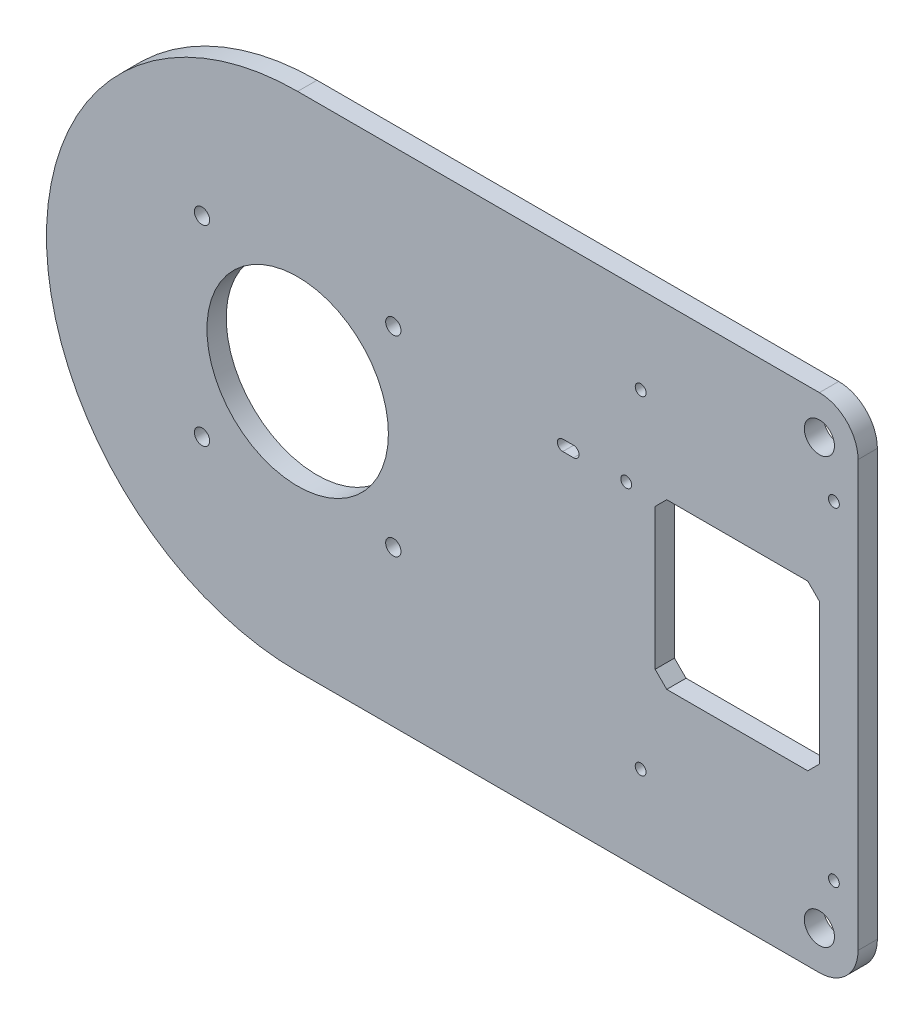
ISO-10303-21;
HEADER;
FILE_DESCRIPTION(('STEP AP214'),'2;1');
FILE_NAME('part.step','',(''),(''),'','','');
FILE_SCHEMA(('AUTOMOTIVE_DESIGN { 1 0 10303 214 1 1 1 1 }'));
ENDSEC;
DATA;
#1=APPLICATION_CONTEXT('core data for automotive mechanical design processes');
#2=APPLICATION_PROTOCOL_DEFINITION('international standard','automotive_design',2000,#1);
#3=PRODUCT_CONTEXT('',#1,'mechanical');
#4=PRODUCT('Part','Part','',(#3));
#5=PRODUCT_RELATED_PRODUCT_CATEGORY('part','',(#4));
#6=PRODUCT_DEFINITION_FORMATION('','',#4);
#7=PRODUCT_DEFINITION_CONTEXT('part definition',#1,'design');
#8=PRODUCT_DEFINITION('design','',#6,#7);
#9=PRODUCT_DEFINITION_SHAPE('','',#8);
#10=(LENGTH_UNIT() NAMED_UNIT(*) SI_UNIT(.MILLI.,.METRE.));
#11=(NAMED_UNIT(*) PLANE_ANGLE_UNIT() SI_UNIT($,.RADIAN.));
#12=(NAMED_UNIT(*) SI_UNIT($,.STERADIAN.) SOLID_ANGLE_UNIT());
#13=UNCERTAINTY_MEASURE_WITH_UNIT(LENGTH_MEASURE(1.E-05),#10,'distance_accuracy_value','');
#14=(GEOMETRIC_REPRESENTATION_CONTEXT(3) GLOBAL_UNCERTAINTY_ASSIGNED_CONTEXT((#13)) GLOBAL_UNIT_ASSIGNED_CONTEXT((#10,
#11,#12)) REPRESENTATION_CONTEXT('',''));
#15=CARTESIAN_POINT('',(0.,0.,0.));
#16=DIRECTION('',(0.,0.,1.));
#17=DIRECTION('',(1.,0.,0.));
#18=AXIS2_PLACEMENT_3D('',#15,#16,#17);
#19=CARTESIAN_POINT('',(-40.,0.,5.));
#20=DIRECTION('',(0.,0.,1.));
#21=DIRECTION('',(1.,0.,0.));
#22=AXIS2_PLACEMENT_3D('',#19,#20,#21);
#23=PLANE('',#22);
#24=CARTESIAN_POINT('',(48.75,-42.5,5.));
#25=DIRECTION('',(0.,0.,1.));
#26=DIRECTION('',(1.,0.,0.));
#27=AXIS2_PLACEMENT_3D('',#24,#25,#26);
#28=CIRCLE('',#27,1.4);
#29=CARTESIAN_POINT('',(50.15,-42.5,5.));
#30=VERTEX_POINT('',#29);
#31=EDGE_CURVE('E199',#30,#30,#28,.T.);
#32=ORIENTED_EDGE('',*,*,#31,.F.);
#33=EDGE_LOOP('',(#32));
#34=FACE_BOUND('',#33,.T.);
#35=CARTESIAN_POINT('',(98.75,-42.5,5.));
#36=DIRECTION('',(0.,0.,1.));
#37=DIRECTION('',(-1.,0.,0.));
#38=AXIS2_PLACEMENT_3D('',#35,#36,#37);
#39=CIRCLE('',#38,1.4);
#40=CARTESIAN_POINT('',(97.35,-42.5,5.));
#41=VERTEX_POINT('',#40);
#42=EDGE_CURVE('E211',#41,#41,#39,.T.);
#43=ORIENTED_EDGE('',*,*,#42,.F.);
#44=EDGE_LOOP('',(#43));
#45=FACE_BOUND('',#44,.T.);
#46=DIRECTION('',(0.,-1.,0.));
#47=VECTOR('',#46,1.);
#48=CARTESIAN_POINT('',(52.5,18.25,5.));
#49=LINE('',#48,#47);
#50=CARTESIAN_POINT('',(52.5,18.25,5.));
#51=VERTEX_POINT('',#50);
#52=CARTESIAN_POINT('',(52.5,-18.25,5.));
#53=VERTEX_POINT('',#52);
#54=EDGE_CURVE('E225',#51,#53,#49,.T.);
#55=ORIENTED_EDGE('',*,*,#54,.F.);
#56=DIRECTION('',(-0.707106781186548,-0.707106781186547,0.));
#57=VECTOR('',#56,1.);
#58=CARTESIAN_POINT('',(55.5,21.25,5.));
#59=LINE('',#58,#57);
#60=CARTESIAN_POINT('',(55.5,21.25,5.));
#61=VERTEX_POINT('',#60);
#62=EDGE_CURVE('E223',#61,#51,#59,.T.);
#63=ORIENTED_EDGE('',*,*,#62,.F.);
#64=DIRECTION('',(-1.,0.,0.));
#65=VECTOR('',#64,1.);
#66=CARTESIAN_POINT('',(92.,21.25,5.));
#67=LINE('',#66,#65);
#68=CARTESIAN_POINT('',(92.,21.25,5.));
#69=VERTEX_POINT('',#68);
#70=EDGE_CURVE('E239',#69,#61,#67,.T.);
#71=ORIENTED_EDGE('',*,*,#70,.F.);
#72=DIRECTION('',(-0.70710678118655,0.707106781186545,0.));
#73=VECTOR('',#72,1.);
#74=CARTESIAN_POINT('',(92.,21.25,5.));
#75=LINE('',#74,#73);
#76=CARTESIAN_POINT('',(95.,18.25,5.));
#77=VERTEX_POINT('',#76);
#78=EDGE_CURVE('E236',#77,#69,#75,.T.);
#79=ORIENTED_EDGE('',*,*,#78,.F.);
#80=DIRECTION('',(0.,1.,0.));
#81=VECTOR('',#80,1.);
#82=CARTESIAN_POINT('',(95.,18.25,5.));
#83=LINE('',#82,#81);
#84=CARTESIAN_POINT('',(95.,-18.25,5.));
#85=VERTEX_POINT('',#84);
#86=EDGE_CURVE('E234',#85,#77,#83,.T.);
#87=ORIENTED_EDGE('',*,*,#86,.F.);
#88=DIRECTION('',(0.70710678118655,0.707106781186545,0.));
#89=VECTOR('',#88,1.);
#90=CARTESIAN_POINT('',(95.,-18.25,5.));
#91=LINE('',#90,#89);
#92=CARTESIAN_POINT('',(92.,-21.25,5.));
#93=VERTEX_POINT('',#92);
#94=EDGE_CURVE('E232',#93,#85,#91,.T.);
#95=ORIENTED_EDGE('',*,*,#94,.F.);
#96=DIRECTION('',(1.,0.,0.));
#97=VECTOR('',#96,1.);
#98=CARTESIAN_POINT('',(55.5,-21.25,5.));
#99=LINE('',#98,#97);
#100=CARTESIAN_POINT('',(55.5,-21.25,5.));
#101=VERTEX_POINT('',#100);
#102=EDGE_CURVE('E230',#101,#93,#99,.T.);
#103=ORIENTED_EDGE('',*,*,#102,.F.);
#104=DIRECTION('',(0.707106781186547,-0.707106781186547,0.));
#105=VECTOR('',#104,1.);
#106=CARTESIAN_POINT('',(52.5,-18.25,5.));
#107=LINE('',#106,#105);
#108=EDGE_CURVE('E228',#53,#101,#107,.T.);
#109=ORIENTED_EDGE('',*,*,#108,.F.);
#110=EDGE_LOOP('',(#55,#63,#71,#79,#87,#95,#103,#109));
#111=FACE_BOUND('',#110,.T.);
#112=CARTESIAN_POINT('',(-64.75,-24.75,5.));
#113=DIRECTION('',(0.,0.,1.));
#114=DIRECTION('',(-1.,0.,0.));
#115=AXIS2_PLACEMENT_3D('',#112,#113,#114);
#116=CIRCLE('',#115,1.97500000000001);
#117=CARTESIAN_POINT('',(-66.725,-24.75,5.));
#118=VERTEX_POINT('',#117);
#119=EDGE_CURVE('E282',#118,#118,#116,.T.);
#120=ORIENTED_EDGE('',*,*,#119,.F.);
#121=EDGE_LOOP('',(#120));
#122=FACE_BOUND('',#121,.T.);
#123=CARTESIAN_POINT('',(-15.25,24.75,5.));
#124=DIRECTION('',(0.,0.,1.));
#125=DIRECTION('',(-1.,0.,0.));
#126=AXIS2_PLACEMENT_3D('',#123,#124,#125);
#127=CIRCLE('',#126,1.975);
#128=CARTESIAN_POINT('',(-17.225,24.75,5.));
#129=VERTEX_POINT('',#128);
#130=EDGE_CURVE('E294',#129,#129,#127,.T.);
#131=ORIENTED_EDGE('',*,*,#130,.F.);
#132=EDGE_LOOP('',(#131));
#133=FACE_BOUND('',#132,.T.);
#134=CARTESIAN_POINT('',(-40.,0.,5.));
#135=DIRECTION('',(0.,0.,1.));
#136=DIRECTION('',(1.,0.,0.));
#137=AXIS2_PLACEMENT_3D('',#134,#135,#136);
#138=CIRCLE('',#137,23.48);
#139=CARTESIAN_POINT('',(-16.52,0.,5.));
#140=VERTEX_POINT('',#139);
#141=EDGE_CURVE('E306',#140,#140,#138,.T.);
#142=ORIENTED_EDGE('',*,*,#141,.F.);
#143=EDGE_LOOP('',(#142));
#144=FACE_BOUND('',#143,.T.);
#145=CARTESIAN_POINT('',(95.,55.,5.));
#146=DIRECTION('',(0.,0.,1.));
#147=DIRECTION('',(1.,0.,0.));
#148=AXIS2_PLACEMENT_3D('',#145,#146,#147);
#149=CIRCLE('',#148,3.9);
#150=CARTESIAN_POINT('',(98.9,55.,5.));
#151=VERTEX_POINT('',#150);
#152=EDGE_CURVE('E318',#151,#151,#149,.T.);
#153=ORIENTED_EDGE('',*,*,#152,.F.);
#154=EDGE_LOOP('',(#153));
#155=FACE_BOUND('',#154,.T.);
#156=CARTESIAN_POINT('',(-40.,0.,5.));
#157=DIRECTION('',(0.,0.,1.));
#158=DIRECTION('',(1.,0.,0.));
#159=AXIS2_PLACEMENT_3D('',#156,#157,#158);
#160=CIRCLE('',#159,65.);
#161=CARTESIAN_POINT('',(-40.,65.,5.));
#162=VERTEX_POINT('',#161);
#163=CARTESIAN_POINT('',(-40.,-65.,5.));
#164=VERTEX_POINT('',#163);
#165=EDGE_CURVE('E324',#162,#164,#160,.T.);
#166=ORIENTED_EDGE('',*,*,#165,.T.);
#167=DIRECTION('',(1.,0.,0.));
#168=VECTOR('',#167,1.);
#169=CARTESIAN_POINT('',(-40.,-65.,5.));
#170=LINE('',#169,#168);
#171=CARTESIAN_POINT('',(94.9999999999999,-65.,5.));
#172=VERTEX_POINT('',#171);
#173=EDGE_CURVE('E327',#164,#172,#170,.T.);
#174=ORIENTED_EDGE('',*,*,#173,.T.);
#175=CARTESIAN_POINT('',(95.,-55.,5.));
#176=DIRECTION('',(0.,0.,1.));
#177=DIRECTION('',(1.,0.,0.));
#178=AXIS2_PLACEMENT_3D('',#175,#176,#177);
#179=CIRCLE('',#178,10.);
#180=CARTESIAN_POINT('',(105.,-54.9999999999999,5.));
#181=VERTEX_POINT('',#180);
#182=EDGE_CURVE('E330',#172,#181,#179,.T.);
#183=ORIENTED_EDGE('',*,*,#182,.T.);
#184=DIRECTION('',(0.,1.,0.));
#185=VECTOR('',#184,1.);
#186=CARTESIAN_POINT('',(105.,54.9999999999999,5.));
#187=LINE('',#186,#185);
#188=CARTESIAN_POINT('',(105.,54.9999999999999,5.));
#189=VERTEX_POINT('',#188);
#190=EDGE_CURVE('E332',#181,#189,#187,.T.);
#191=ORIENTED_EDGE('',*,*,#190,.T.);
#192=CARTESIAN_POINT('',(95.,55.,5.));
#193=DIRECTION('',(0.,0.,1.));
#194=DIRECTION('',(-1.,0.,0.));
#195=AXIS2_PLACEMENT_3D('',#192,#193,#194);
#196=CIRCLE('',#195,10.);
#197=CARTESIAN_POINT('',(94.9999999999999,65.,5.));
#198=VERTEX_POINT('',#197);
#199=EDGE_CURVE('E334',#189,#198,#196,.T.);
#200=ORIENTED_EDGE('',*,*,#199,.T.);
#201=DIRECTION('',(-1.,0.,0.));
#202=VECTOR('',#201,1.);
#203=CARTESIAN_POINT('',(-40.,65.,5.));
#204=LINE('',#203,#202);
#205=EDGE_CURVE('E336',#198,#162,#204,.T.);
#206=ORIENTED_EDGE('',*,*,#205,.T.);
#207=EDGE_LOOP('',(#166,#174,#183,#191,#200,#206));
#208=FACE_BOUND('',#207,.T.);
#209=CARTESIAN_POINT('',(95.,-55.,5.));
#210=DIRECTION('',(0.,0.,1.));
#211=DIRECTION('',(-1.,0.,0.));
#212=AXIS2_PLACEMENT_3D('',#209,#210,#211);
#213=CIRCLE('',#212,3.9);
#214=CARTESIAN_POINT('',(91.1,-55.,5.));
#215=VERTEX_POINT('',#214);
#216=EDGE_CURVE('E312',#215,#215,#213,.T.);
#217=ORIENTED_EDGE('',*,*,#216,.F.);
#218=EDGE_LOOP('',(#217));
#219=FACE_BOUND('',#218,.T.);
#220=CARTESIAN_POINT('',(-64.75,24.75,5.));
#221=DIRECTION('',(0.,0.,1.));
#222=DIRECTION('',(1.,0.,0.));
#223=AXIS2_PLACEMENT_3D('',#220,#221,#222);
#224=CIRCLE('',#223,1.97500000000001);
#225=CARTESIAN_POINT('',(-62.775,24.75,5.));
#226=VERTEX_POINT('',#225);
#227=EDGE_CURVE('E300',#226,#226,#224,.T.);
#228=ORIENTED_EDGE('',*,*,#227,.F.);
#229=EDGE_LOOP('',(#228));
#230=FACE_BOUND('',#229,.T.);
#231=CARTESIAN_POINT('',(-15.25,-24.75,5.));
#232=DIRECTION('',(0.,0.,1.));
#233=DIRECTION('',(1.,0.,0.));
#234=AXIS2_PLACEMENT_3D('',#231,#232,#233);
#235=CIRCLE('',#234,1.975);
#236=CARTESIAN_POINT('',(-13.275,-24.75,5.));
#237=VERTEX_POINT('',#236);
#238=EDGE_CURVE('E288',#237,#237,#235,.T.);
#239=ORIENTED_EDGE('',*,*,#238,.F.);
#240=EDGE_LOOP('',(#239));
#241=FACE_BOUND('',#240,.T.);
#242=CARTESIAN_POINT('',(98.75,42.5,5.));
#243=DIRECTION('',(0.,0.,1.));
#244=DIRECTION('',(1.,0.,0.));
#245=AXIS2_PLACEMENT_3D('',#242,#243,#244);
#246=CIRCLE('',#245,1.4);
#247=CARTESIAN_POINT('',(100.15,42.5,5.));
#248=VERTEX_POINT('',#247);
#249=EDGE_CURVE('E217',#248,#248,#246,.T.);
#250=ORIENTED_EDGE('',*,*,#249,.F.);
#251=EDGE_LOOP('',(#250));
#252=FACE_BOUND('',#251,.T.);
#253=CARTESIAN_POINT('',(48.75,42.5,5.));
#254=DIRECTION('',(0.,0.,1.));
#255=DIRECTION('',(-1.,0.,0.));
#256=AXIS2_PLACEMENT_3D('',#253,#254,#255);
#257=CIRCLE('',#256,1.4);
#258=CARTESIAN_POINT('',(47.35,42.5,5.));
#259=VERTEX_POINT('',#258);
#260=EDGE_CURVE('E205',#259,#259,#257,.T.);
#261=ORIENTED_EDGE('',*,*,#260,.F.);
#262=EDGE_LOOP('',(#261));
#263=FACE_BOUND('',#262,.T.);
#264=CARTESIAN_POINT('',(45.,20.,5.));
#265=DIRECTION('',(0.,0.,1.));
#266=DIRECTION('',(1.,0.,0.));
#267=AXIS2_PLACEMENT_3D('',#264,#265,#266);
#268=CIRCLE('',#267,1.4);
#269=CARTESIAN_POINT('',(46.4,20.,5.));
#270=VERTEX_POINT('',#269);
#271=EDGE_CURVE('E193',#270,#270,#268,.T.);
#272=ORIENTED_EDGE('',*,*,#271,.F.);
#273=EDGE_LOOP('',(#272));
#274=FACE_BOUND('',#273,.T.);
#275=DIRECTION('',(1.,0.,0.));
#276=VECTOR('',#275,1.);
#277=CARTESIAN_POINT('',(28.6,18.6,5.));
#278=LINE('',#277,#276);
#279=CARTESIAN_POINT('',(28.6,18.6,5.));
#280=VERTEX_POINT('',#279);
#281=CARTESIAN_POINT('',(31.4,18.6,5.));
#282=VERTEX_POINT('',#281);
#283=EDGE_CURVE('E165',#280,#282,#278,.T.);
#284=ORIENTED_EDGE('',*,*,#283,.F.);
#285=CARTESIAN_POINT('',(28.6,20.,5.));
#286=DIRECTION('',(0.,0.,1.));
#287=DIRECTION('',(1.,0.,0.));
#288=AXIS2_PLACEMENT_3D('',#285,#286,#287);
#289=CIRCLE('',#288,1.4);
#290=CARTESIAN_POINT('',(28.6,21.4,5.));
#291=VERTEX_POINT('',#290);
#292=EDGE_CURVE('E157',#291,#280,#289,.T.);
#293=ORIENTED_EDGE('',*,*,#292,.F.);
#294=DIRECTION('',(-1.,0.,0.));
#295=VECTOR('',#294,1.);
#296=CARTESIAN_POINT('',(28.6,21.4,5.));
#297=LINE('',#296,#295);
#298=CARTESIAN_POINT('',(31.4,21.4,5.));
#299=VERTEX_POINT('',#298);
#300=EDGE_CURVE('E179',#299,#291,#297,.T.);
#301=ORIENTED_EDGE('',*,*,#300,.F.);
#302=CARTESIAN_POINT('',(31.4,20.,5.));
#303=DIRECTION('',(0.,0.,1.));
#304=DIRECTION('',(1.,0.,0.));
#305=AXIS2_PLACEMENT_3D('',#302,#303,#304);
#306=CIRCLE('',#305,1.4);
#307=EDGE_CURVE('E177',#282,#299,#306,.T.);
#308=ORIENTED_EDGE('',*,*,#307,.F.);
#309=EDGE_LOOP('',(#284,#293,#301,#308));
#310=FACE_BOUND('',#309,.T.);
#311=ADVANCED_FACE('F32',(#34,#45,#111,#122,#133,#144,#155,#208,#219,#230,#241,#252,#263,#274,
#310),#23,.T.);
#312=CARTESIAN_POINT('',(-40.,0.,0.));
#313=DIRECTION('',(0.,0.,1.));
#314=DIRECTION('',(1.,0.,0.));
#315=AXIS2_PLACEMENT_3D('',#312,#313,#314);
#316=PLANE('',#315);
#317=CARTESIAN_POINT('',(45.,20.,0.));
#318=DIRECTION('',(0.,0.,1.));
#319=DIRECTION('',(1.,0.,0.));
#320=AXIS2_PLACEMENT_3D('',#317,#318,#319);
#321=CIRCLE('',#320,1.4);
#322=CARTESIAN_POINT('',(46.4,20.,0.));
#323=VERTEX_POINT('',#322);
#324=EDGE_CURVE('E173',#323,#323,#321,.T.);
#325=ORIENTED_EDGE('',*,*,#324,.T.);
#326=EDGE_LOOP('',(#325));
#327=FACE_BOUND('',#326,.T.);
#328=CARTESIAN_POINT('',(48.75,-42.5,0.));
#329=DIRECTION('',(0.,0.,1.));
#330=DIRECTION('',(1.,0.,0.));
#331=AXIS2_PLACEMENT_3D('',#328,#329,#330);
#332=CIRCLE('',#331,1.4);
#333=CARTESIAN_POINT('',(50.15,-42.5,0.));
#334=VERTEX_POINT('',#333);
#335=EDGE_CURVE('E196',#334,#334,#332,.T.);
#336=ORIENTED_EDGE('',*,*,#335,.T.);
#337=EDGE_LOOP('',(#336));
#338=FACE_BOUND('',#337,.T.);
#339=CARTESIAN_POINT('',(48.75,42.5,0.));
#340=DIRECTION('',(0.,0.,1.));
#341=DIRECTION('',(-1.,0.,0.));
#342=AXIS2_PLACEMENT_3D('',#339,#340,#341);
#343=CIRCLE('',#342,1.4);
#344=CARTESIAN_POINT('',(47.35,42.5,0.));
#345=VERTEX_POINT('',#344);
#346=EDGE_CURVE('E202',#345,#345,#343,.T.);
#347=ORIENTED_EDGE('',*,*,#346,.T.);
#348=EDGE_LOOP('',(#347));
#349=FACE_BOUND('',#348,.T.);
#350=CARTESIAN_POINT('',(98.75,-42.5,0.));
#351=DIRECTION('',(0.,0.,1.));
#352=DIRECTION('',(-1.,0.,0.));
#353=AXIS2_PLACEMENT_3D('',#350,#351,#352);
#354=CIRCLE('',#353,1.4);
#355=CARTESIAN_POINT('',(97.35,-42.5,0.));
#356=VERTEX_POINT('',#355);
#357=EDGE_CURVE('E208',#356,#356,#354,.T.);
#358=ORIENTED_EDGE('',*,*,#357,.T.);
#359=EDGE_LOOP('',(#358));
#360=FACE_BOUND('',#359,.T.);
#361=CARTESIAN_POINT('',(98.75,42.5,0.));
#362=DIRECTION('',(0.,0.,1.));
#363=DIRECTION('',(1.,0.,0.));
#364=AXIS2_PLACEMENT_3D('',#361,#362,#363);
#365=CIRCLE('',#364,1.4);
#366=CARTESIAN_POINT('',(100.15,42.5,0.));
#367=VERTEX_POINT('',#366);
#368=EDGE_CURVE('E214',#367,#367,#365,.T.);
#369=ORIENTED_EDGE('',*,*,#368,.T.);
#370=EDGE_LOOP('',(#369));
#371=FACE_BOUND('',#370,.T.);
#372=DIRECTION('',(-0.707106781186548,-0.707106781186547,0.));
#373=VECTOR('',#372,1.);
#374=CARTESIAN_POINT('',(55.5,21.25,0.));
#375=LINE('',#374,#373);
#376=CARTESIAN_POINT('',(55.5,21.25,0.));
#377=VERTEX_POINT('',#376);
#378=CARTESIAN_POINT('',(52.5,18.25,0.));
#379=VERTEX_POINT('',#378);
#380=EDGE_CURVE('E220',#377,#379,#375,.T.);
#381=ORIENTED_EDGE('',*,*,#380,.T.);
#382=DIRECTION('',(0.,-1.,0.));
#383=VECTOR('',#382,1.);
#384=CARTESIAN_POINT('',(52.5,18.25,0.));
#385=LINE('',#384,#383);
#386=CARTESIAN_POINT('',(52.5,-18.25,0.));
#387=VERTEX_POINT('',#386);
#388=EDGE_CURVE('E244',#379,#387,#385,.T.);
#389=ORIENTED_EDGE('',*,*,#388,.T.);
#390=DIRECTION('',(0.707106781186547,-0.707106781186547,0.));
#391=VECTOR('',#390,1.);
#392=CARTESIAN_POINT('',(52.5,-18.25,0.));
#393=LINE('',#392,#391);
#394=CARTESIAN_POINT('',(55.5,-21.25,0.));
#395=VERTEX_POINT('',#394);
#396=EDGE_CURVE('E247',#387,#395,#393,.T.);
#397=ORIENTED_EDGE('',*,*,#396,.T.);
#398=DIRECTION('',(1.,0.,0.));
#399=VECTOR('',#398,1.);
#400=CARTESIAN_POINT('',(55.5,-21.25,0.));
#401=LINE('',#400,#399);
#402=CARTESIAN_POINT('',(92.,-21.25,0.));
#403=VERTEX_POINT('',#402);
#404=EDGE_CURVE('E250',#395,#403,#401,.T.);
#405=ORIENTED_EDGE('',*,*,#404,.T.);
#406=DIRECTION('',(0.70710678118655,0.707106781186545,0.));
#407=VECTOR('',#406,1.);
#408=CARTESIAN_POINT('',(95.,-18.25,0.));
#409=LINE('',#408,#407);
#410=CARTESIAN_POINT('',(95.,-18.25,0.));
#411=VERTEX_POINT('',#410);
#412=EDGE_CURVE('E253',#403,#411,#409,.T.);
#413=ORIENTED_EDGE('',*,*,#412,.T.);
#414=DIRECTION('',(0.,1.,0.));
#415=VECTOR('',#414,1.);
#416=CARTESIAN_POINT('',(95.,18.25,0.));
#417=LINE('',#416,#415);
#418=CARTESIAN_POINT('',(95.,18.25,0.));
#419=VERTEX_POINT('',#418);
#420=EDGE_CURVE('E256',#411,#419,#417,.T.);
#421=ORIENTED_EDGE('',*,*,#420,.T.);
#422=DIRECTION('',(-0.70710678118655,0.707106781186545,0.));
#423=VECTOR('',#422,1.);
#424=CARTESIAN_POINT('',(92.,21.25,0.));
#425=LINE('',#424,#423);
#426=CARTESIAN_POINT('',(92.,21.25,0.));
#427=VERTEX_POINT('',#426);
#428=EDGE_CURVE('E259',#419,#427,#425,.T.);
#429=ORIENTED_EDGE('',*,*,#428,.T.);
#430=DIRECTION('',(-1.,0.,0.));
#431=VECTOR('',#430,1.);
#432=CARTESIAN_POINT('',(92.,21.25,0.));
#433=LINE('',#432,#431);
#434=EDGE_CURVE('E226',#427,#377,#433,.T.);
#435=ORIENTED_EDGE('',*,*,#434,.T.);
#436=EDGE_LOOP('',(#381,#389,#397,#405,#413,#421,#429,#435));
#437=FACE_BOUND('',#436,.T.);
#438=CARTESIAN_POINT('',(-40.,0.,0.));
#439=DIRECTION('',(0.,0.,1.));
#440=DIRECTION('',(1.,0.,0.));
#441=AXIS2_PLACEMENT_3D('',#438,#439,#440);
#442=CIRCLE('',#441,65.);
#443=CARTESIAN_POINT('',(-40.,65.,0.));
#444=VERTEX_POINT('',#443);
#445=CARTESIAN_POINT('',(-40.,-65.,0.));
#446=VERTEX_POINT('',#445);
#447=EDGE_CURVE('E321',#444,#446,#442,.T.);
#448=ORIENTED_EDGE('',*,*,#447,.F.);
#449=DIRECTION('',(-1.,0.,0.));
#450=VECTOR('',#449,1.);
#451=CARTESIAN_POINT('',(-40.,65.,0.));
#452=LINE('',#451,#450);
#453=CARTESIAN_POINT('',(94.9999999999999,65.,0.));
#454=VERTEX_POINT('',#453);
#455=EDGE_CURVE('E328',#454,#444,#452,.T.);
#456=ORIENTED_EDGE('',*,*,#455,.F.);
#457=CARTESIAN_POINT('',(95.,55.,0.));
#458=DIRECTION('',(0.,0.,1.));
#459=DIRECTION('',(-1.,0.,0.));
#460=AXIS2_PLACEMENT_3D('',#457,#458,#459);
#461=CIRCLE('',#460,10.);
#462=CARTESIAN_POINT('',(105.,54.9999999999999,0.));
#463=VERTEX_POINT('',#462);
#464=EDGE_CURVE('E347',#463,#454,#461,.T.);
#465=ORIENTED_EDGE('',*,*,#464,.F.);
#466=DIRECTION('',(0.,1.,0.));
#467=VECTOR('',#466,1.);
#468=CARTESIAN_POINT('',(105.,54.9999999999999,0.));
#469=LINE('',#468,#467);
#470=CARTESIAN_POINT('',(105.,-54.9999999999999,0.));
#471=VERTEX_POINT('',#470);
#472=EDGE_CURVE('E345',#471,#463,#469,.T.);
#473=ORIENTED_EDGE('',*,*,#472,.F.);
#474=CARTESIAN_POINT('',(95.,-55.,0.));
#475=DIRECTION('',(0.,0.,1.));
#476=DIRECTION('',(1.,0.,0.));
#477=AXIS2_PLACEMENT_3D('',#474,#475,#476);
#478=CIRCLE('',#477,10.);
#479=CARTESIAN_POINT('',(94.9999999999999,-65.,0.));
#480=VERTEX_POINT('',#479);
#481=EDGE_CURVE('E343',#480,#471,#478,.T.);
#482=ORIENTED_EDGE('',*,*,#481,.F.);
#483=DIRECTION('',(1.,0.,0.));
#484=VECTOR('',#483,1.);
#485=CARTESIAN_POINT('',(-40.,-65.,0.));
#486=LINE('',#485,#484);
#487=EDGE_CURVE('E341',#446,#480,#486,.T.);
#488=ORIENTED_EDGE('',*,*,#487,.F.);
#489=EDGE_LOOP('',(#448,#456,#465,#473,#482,#488));
#490=FACE_BOUND('',#489,.T.);
#491=CARTESIAN_POINT('',(95.,55.,0.));
#492=DIRECTION('',(0.,0.,1.));
#493=DIRECTION('',(1.,0.,0.));
#494=AXIS2_PLACEMENT_3D('',#491,#492,#493);
#495=CIRCLE('',#494,3.9);
#496=CARTESIAN_POINT('',(98.9,55.,0.));
#497=VERTEX_POINT('',#496);
#498=EDGE_CURVE('E315',#497,#497,#495,.T.);
#499=ORIENTED_EDGE('',*,*,#498,.T.);
#500=EDGE_LOOP('',(#499));
#501=FACE_BOUND('',#500,.T.);
#502=CARTESIAN_POINT('',(95.,-55.,0.));
#503=DIRECTION('',(0.,0.,1.));
#504=DIRECTION('',(-1.,0.,0.));
#505=AXIS2_PLACEMENT_3D('',#502,#503,#504);
#506=CIRCLE('',#505,3.9);
#507=CARTESIAN_POINT('',(91.1,-55.,0.));
#508=VERTEX_POINT('',#507);
#509=EDGE_CURVE('E309',#508,#508,#506,.T.);
#510=ORIENTED_EDGE('',*,*,#509,.T.);
#511=EDGE_LOOP('',(#510));
#512=FACE_BOUND('',#511,.T.);
#513=CARTESIAN_POINT('',(-40.,0.,0.));
#514=DIRECTION('',(0.,0.,1.));
#515=DIRECTION('',(1.,0.,0.));
#516=AXIS2_PLACEMENT_3D('',#513,#514,#515);
#517=CIRCLE('',#516,23.48);
#518=CARTESIAN_POINT('',(-16.52,0.,0.));
#519=VERTEX_POINT('',#518);
#520=EDGE_CURVE('E303',#519,#519,#517,.T.);
#521=ORIENTED_EDGE('',*,*,#520,.T.);
#522=EDGE_LOOP('',(#521));
#523=FACE_BOUND('',#522,.T.);
#524=CARTESIAN_POINT('',(-64.75,24.75,0.));
#525=DIRECTION('',(0.,0.,1.));
#526=DIRECTION('',(1.,0.,0.));
#527=AXIS2_PLACEMENT_3D('',#524,#525,#526);
#528=CIRCLE('',#527,1.97500000000001);
#529=CARTESIAN_POINT('',(-62.775,24.75,0.));
#530=VERTEX_POINT('',#529);
#531=EDGE_CURVE('E297',#530,#530,#528,.T.);
#532=ORIENTED_EDGE('',*,*,#531,.T.);
#533=EDGE_LOOP('',(#532));
#534=FACE_BOUND('',#533,.T.);
#535=CARTESIAN_POINT('',(-15.25,24.75,0.));
#536=DIRECTION('',(0.,0.,1.));
#537=DIRECTION('',(-1.,0.,0.));
#538=AXIS2_PLACEMENT_3D('',#535,#536,#537);
#539=CIRCLE('',#538,1.975);
#540=CARTESIAN_POINT('',(-17.225,24.75,0.));
#541=VERTEX_POINT('',#540);
#542=EDGE_CURVE('E291',#541,#541,#539,.T.);
#543=ORIENTED_EDGE('',*,*,#542,.T.);
#544=EDGE_LOOP('',(#543));
#545=FACE_BOUND('',#544,.T.);
#546=CARTESIAN_POINT('',(-15.25,-24.75,0.));
#547=DIRECTION('',(0.,0.,1.));
#548=DIRECTION('',(1.,0.,0.));
#549=AXIS2_PLACEMENT_3D('',#546,#547,#548);
#550=CIRCLE('',#549,1.975);
#551=CARTESIAN_POINT('',(-13.275,-24.75,0.));
#552=VERTEX_POINT('',#551);
#553=EDGE_CURVE('E285',#552,#552,#550,.T.);
#554=ORIENTED_EDGE('',*,*,#553,.T.);
#555=EDGE_LOOP('',(#554));
#556=FACE_BOUND('',#555,.T.);
#557=CARTESIAN_POINT('',(-64.75,-24.75,0.));
#558=DIRECTION('',(0.,0.,1.));
#559=DIRECTION('',(-1.,0.,0.));
#560=AXIS2_PLACEMENT_3D('',#557,#558,#559);
#561=CIRCLE('',#560,1.97500000000001);
#562=CARTESIAN_POINT('',(-66.725,-24.75,0.));
#563=VERTEX_POINT('',#562);
#564=EDGE_CURVE('E281',#563,#563,#561,.T.);
#565=ORIENTED_EDGE('',*,*,#564,.T.);
#566=EDGE_LOOP('',(#565));
#567=FACE_BOUND('',#566,.T.);
#568=CARTESIAN_POINT('',(28.6,20.,0.));
#569=DIRECTION('',(0.,0.,1.));
#570=DIRECTION('',(1.,0.,0.));
#571=AXIS2_PLACEMENT_3D('',#568,#569,#570);
#572=CIRCLE('',#571,1.4);
#573=CARTESIAN_POINT('',(28.6,21.4,0.));
#574=VERTEX_POINT('',#573);
#575=CARTESIAN_POINT('',(28.6,18.6,0.));
#576=VERTEX_POINT('',#575);
#577=EDGE_CURVE('E55',#574,#576,#572,.T.);
#578=ORIENTED_EDGE('',*,*,#577,.T.);
#579=DIRECTION('',(1.,0.,0.));
#580=VECTOR('',#579,1.);
#581=CARTESIAN_POINT('',(28.6,18.6,0.));
#582=LINE('',#581,#580);
#583=CARTESIAN_POINT('',(31.4,18.6,0.));
#584=VERTEX_POINT('',#583);
#585=EDGE_CURVE('E172',#576,#584,#582,.T.);
#586=ORIENTED_EDGE('',*,*,#585,.T.);
#587=CARTESIAN_POINT('',(31.4,20.,0.));
#588=DIRECTION('',(0.,0.,1.));
#589=DIRECTION('',(1.,0.,0.));
#590=AXIS2_PLACEMENT_3D('',#587,#588,#589);
#591=CIRCLE('',#590,1.4);
#592=CARTESIAN_POINT('',(31.4,21.4,0.));
#593=VERTEX_POINT('',#592);
#594=EDGE_CURVE('E185',#584,#593,#591,.T.);
#595=ORIENTED_EDGE('',*,*,#594,.T.);
#596=DIRECTION('',(-1.,0.,0.));
#597=VECTOR('',#596,1.);
#598=CARTESIAN_POINT('',(28.6,21.4,0.));
#599=LINE('',#598,#597);
#600=EDGE_CURVE('E166',#593,#574,#599,.T.);
#601=ORIENTED_EDGE('',*,*,#600,.T.);
#602=EDGE_LOOP('',(#578,#586,#595,#601));
#603=FACE_BOUND('',#602,.T.);
#604=ADVANCED_FACE('F371',(#327,#338,#349,#360,#371,#437,#490,#501,#512,#523,#534,#545,#556,
#567,#603),#316,.F.);
#605=CARTESIAN_POINT('',(-40.,0.,5.));
#606=DIRECTION('',(0.,0.,-1.));
#607=DIRECTION('',(-1.,0.,0.));
#608=AXIS2_PLACEMENT_3D('',#605,#606,#607);
#609=CYLINDRICAL_SURFACE('',#608,65.);
#610=ORIENTED_EDGE('',*,*,#447,.T.);
#611=DIRECTION('',(0.,0.,-1.));
#612=VECTOR('',#611,1.);
#613=CARTESIAN_POINT('',(-40.,-65.,5.));
#614=LINE('',#613,#612);
#615=EDGE_CURVE('E11',#164,#446,#614,.T.);
#616=ORIENTED_EDGE('',*,*,#615,.F.);
#617=ORIENTED_EDGE('',*,*,#165,.F.);
#618=DIRECTION('',(0.,0.,-1.));
#619=VECTOR('',#618,1.);
#620=CARTESIAN_POINT('',(-40.,65.,5.));
#621=LINE('',#620,#619);
#622=EDGE_CURVE('E338',#162,#444,#621,.T.);
#623=ORIENTED_EDGE('',*,*,#622,.T.);
#624=EDGE_LOOP('',(#610,#616,#617,#623));
#625=FACE_BOUND('',#624,.T.);
#626=ADVANCED_FACE('F34',(#625),#609,.T.);
#627=CARTESIAN_POINT('',(-40.,-65.,5.));
#628=DIRECTION('',(0.,1.,0.));
#629=DIRECTION('',(-1.,0.,0.));
#630=AXIS2_PLACEMENT_3D('',#627,#628,#629);
#631=PLANE('',#630);
#632=ORIENTED_EDGE('',*,*,#487,.T.);
#633=DIRECTION('',(0.,0.,-1.));
#634=VECTOR('',#633,1.);
#635=CARTESIAN_POINT('',(94.9999999999999,-65.,5.));
#636=LINE('',#635,#634);
#637=EDGE_CURVE('E40',#172,#480,#636,.T.);
#638=ORIENTED_EDGE('',*,*,#637,.F.);
#639=ORIENTED_EDGE('',*,*,#173,.F.);
#640=ORIENTED_EDGE('',*,*,#615,.T.);
#641=EDGE_LOOP('',(#632,#638,#639,#640));
#642=FACE_BOUND('',#641,.T.);
#643=ADVANCED_FACE('F389',(#642),#631,.F.);
#644=CARTESIAN_POINT('',(95.,-55.,5.));
#645=DIRECTION('',(0.,0.,-1.));
#646=DIRECTION('',(-1.,0.,0.));
#647=AXIS2_PLACEMENT_3D('',#644,#645,#646);
#648=CYLINDRICAL_SURFACE('',#647,10.);
#649=ORIENTED_EDGE('',*,*,#481,.T.);
#650=DIRECTION('',(0.,0.,-1.));
#651=VECTOR('',#650,1.);
#652=CARTESIAN_POINT('',(105.,-54.9999999999999,5.));
#653=LINE('',#652,#651);
#654=EDGE_CURVE('E358',#181,#471,#653,.T.);
#655=ORIENTED_EDGE('',*,*,#654,.F.);
#656=ORIENTED_EDGE('',*,*,#182,.F.);
#657=ORIENTED_EDGE('',*,*,#637,.T.);
#658=EDGE_LOOP('',(#649,#655,#656,#657));
#659=FACE_BOUND('',#658,.T.);
#660=ADVANCED_FACE('F365',(#659),#648,.T.);
#661=CARTESIAN_POINT('',(105.,54.9999999999999,5.));
#662=DIRECTION('',(-1.,0.,0.));
#663=DIRECTION('',(0.,-1.,0.));
#664=AXIS2_PLACEMENT_3D('',#661,#662,#663);
#665=PLANE('',#664);
#666=ORIENTED_EDGE('',*,*,#472,.T.);
#667=DIRECTION('',(0.,0.,-1.));
#668=VECTOR('',#667,1.);
#669=CARTESIAN_POINT('',(105.,54.9999999999999,5.));
#670=LINE('',#669,#668);
#671=EDGE_CURVE('E355',#189,#463,#670,.T.);
#672=ORIENTED_EDGE('',*,*,#671,.F.);
#673=ORIENTED_EDGE('',*,*,#190,.F.);
#674=ORIENTED_EDGE('',*,*,#654,.T.);
#675=EDGE_LOOP('',(#666,#672,#673,#674));
#676=FACE_BOUND('',#675,.T.);
#677=ADVANCED_FACE('F377',(#676),#665,.F.);
#678=CARTESIAN_POINT('',(95.,55.,5.));
#679=DIRECTION('',(0.,0.,-1.));
#680=DIRECTION('',(-1.,0.,0.));
#681=AXIS2_PLACEMENT_3D('',#678,#679,#680);
#682=CYLINDRICAL_SURFACE('',#681,10.);
#683=ORIENTED_EDGE('',*,*,#464,.T.);
#684=DIRECTION('',(0.,0.,-1.));
#685=VECTOR('',#684,1.);
#686=CARTESIAN_POINT('',(94.9999999999999,65.,5.));
#687=LINE('',#686,#685);
#688=EDGE_CURVE('E352',#198,#454,#687,.T.);
#689=ORIENTED_EDGE('',*,*,#688,.F.);
#690=ORIENTED_EDGE('',*,*,#199,.F.);
#691=ORIENTED_EDGE('',*,*,#671,.T.);
#692=EDGE_LOOP('',(#683,#689,#690,#691));
#693=FACE_BOUND('',#692,.T.);
#694=ADVANCED_FACE('F381',(#693),#682,.T.);
#695=CARTESIAN_POINT('',(-40.,65.,5.));
#696=DIRECTION('',(0.,-1.,0.));
#697=DIRECTION('',(0.,0.,-1.));
#698=AXIS2_PLACEMENT_3D('',#695,#696,#697);
#699=PLANE('',#698);
#700=ORIENTED_EDGE('',*,*,#455,.T.);
#701=ORIENTED_EDGE('',*,*,#622,.F.);
#702=ORIENTED_EDGE('',*,*,#205,.F.);
#703=ORIENTED_EDGE('',*,*,#688,.T.);
#704=EDGE_LOOP('',(#700,#701,#702,#703));
#705=FACE_BOUND('',#704,.T.);
#706=ADVANCED_FACE('F392',(#705),#699,.F.);
#707=CARTESIAN_POINT('',(95.,55.,5.));
#708=DIRECTION('',(0.,0.,-1.));
#709=DIRECTION('',(-1.,0.,0.));
#710=AXIS2_PLACEMENT_3D('',#707,#708,#709);
#711=CYLINDRICAL_SURFACE('',#710,3.9);
#712=ORIENTED_EDGE('',*,*,#152,.T.);
#713=EDGE_LOOP('',(#712));
#714=FACE_BOUND('',#713,.T.);
#715=ORIENTED_EDGE('',*,*,#498,.F.);
#716=EDGE_LOOP('',(#715));
#717=FACE_BOUND('',#716,.T.);
#718=ADVANCED_FACE('F394',(#714,#717),#711,.F.);
#719=CARTESIAN_POINT('',(95.,-55.,5.));
#720=DIRECTION('',(0.,0.,-1.));
#721=DIRECTION('',(-1.,0.,0.));
#722=AXIS2_PLACEMENT_3D('',#719,#720,#721);
#723=CYLINDRICAL_SURFACE('',#722,3.9);
#724=ORIENTED_EDGE('',*,*,#216,.T.);
#725=EDGE_LOOP('',(#724));
#726=FACE_BOUND('',#725,.T.);
#727=ORIENTED_EDGE('',*,*,#509,.F.);
#728=EDGE_LOOP('',(#727));
#729=FACE_BOUND('',#728,.T.);
#730=ADVANCED_FACE('F400',(#726,#729),#723,.F.);
#731=CARTESIAN_POINT('',(-40.,0.,5.));
#732=DIRECTION('',(0.,0.,-1.));
#733=DIRECTION('',(-1.,0.,0.));
#734=AXIS2_PLACEMENT_3D('',#731,#732,#733);
#735=CYLINDRICAL_SURFACE('',#734,23.48);
#736=ORIENTED_EDGE('',*,*,#141,.T.);
#737=EDGE_LOOP('',(#736));
#738=FACE_BOUND('',#737,.T.);
#739=ORIENTED_EDGE('',*,*,#520,.F.);
#740=EDGE_LOOP('',(#739));
#741=FACE_BOUND('',#740,.T.);
#742=ADVANCED_FACE('F417',(#738,#741),#735,.F.);
#743=CARTESIAN_POINT('',(-64.75,24.75,5.));
#744=DIRECTION('',(0.,0.,-1.));
#745=DIRECTION('',(-1.,0.,0.));
#746=AXIS2_PLACEMENT_3D('',#743,#744,#745);
#747=CYLINDRICAL_SURFACE('',#746,1.97500000000001);
#748=ORIENTED_EDGE('',*,*,#227,.T.);
#749=EDGE_LOOP('',(#748));
#750=FACE_BOUND('',#749,.T.);
#751=ORIENTED_EDGE('',*,*,#531,.F.);
#752=EDGE_LOOP('',(#751));
#753=FACE_BOUND('',#752,.T.);
#754=ADVANCED_FACE('F421',(#750,#753),#747,.F.);
#755=CARTESIAN_POINT('',(-15.25,24.75,5.));
#756=DIRECTION('',(0.,0.,-1.));
#757=DIRECTION('',(-1.,0.,0.));
#758=AXIS2_PLACEMENT_3D('',#755,#756,#757);
#759=CYLINDRICAL_SURFACE('',#758,1.975);
#760=ORIENTED_EDGE('',*,*,#130,.T.);
#761=EDGE_LOOP('',(#760));
#762=FACE_BOUND('',#761,.T.);
#763=ORIENTED_EDGE('',*,*,#542,.F.);
#764=EDGE_LOOP('',(#763));
#765=FACE_BOUND('',#764,.T.);
#766=ADVANCED_FACE('F425',(#762,#765),#759,.F.);
#767=CARTESIAN_POINT('',(-15.25,-24.75,5.));
#768=DIRECTION('',(0.,0.,-1.));
#769=DIRECTION('',(-1.,0.,0.));
#770=AXIS2_PLACEMENT_3D('',#767,#768,#769);
#771=CYLINDRICAL_SURFACE('',#770,1.975);
#772=ORIENTED_EDGE('',*,*,#238,.T.);
#773=EDGE_LOOP('',(#772));
#774=FACE_BOUND('',#773,.T.);
#775=ORIENTED_EDGE('',*,*,#553,.F.);
#776=EDGE_LOOP('',(#775));
#777=FACE_BOUND('',#776,.T.);
#778=ADVANCED_FACE('F429',(#774,#777),#771,.F.);
#779=CARTESIAN_POINT('',(-64.75,-24.75,5.));
#780=DIRECTION('',(0.,0.,-1.));
#781=DIRECTION('',(-1.,0.,0.));
#782=AXIS2_PLACEMENT_3D('',#779,#780,#781);
#783=CYLINDRICAL_SURFACE('',#782,1.97500000000001);
#784=ORIENTED_EDGE('',*,*,#119,.T.);
#785=EDGE_LOOP('',(#784));
#786=FACE_BOUND('',#785,.T.);
#787=ORIENTED_EDGE('',*,*,#564,.F.);
#788=EDGE_LOOP('',(#787));
#789=FACE_BOUND('',#788,.T.);
#790=ADVANCED_FACE('F433',(#786,#789),#783,.F.);
#791=CARTESIAN_POINT('',(55.5,21.25,5.));
#792=DIRECTION('',(0.707106781186547,-0.707106781186548,0.));
#793=DIRECTION('',(0.707106781186548,0.707106781186547,0.));
#794=AXIS2_PLACEMENT_3D('',#791,#792,#793);
#795=PLANE('',#794);
#796=ORIENTED_EDGE('',*,*,#380,.F.);
#797=DIRECTION('',(0.,0.,-1.));
#798=VECTOR('',#797,1.);
#799=CARTESIAN_POINT('',(55.5,21.25,5.));
#800=LINE('',#799,#798);
#801=EDGE_CURVE('E241',#61,#377,#800,.T.);
#802=ORIENTED_EDGE('',*,*,#801,.F.);
#803=ORIENTED_EDGE('',*,*,#62,.T.);
#804=DIRECTION('',(0.,0.,-1.));
#805=VECTOR('',#804,1.);
#806=CARTESIAN_POINT('',(52.5,18.25,5.));
#807=LINE('',#806,#805);
#808=EDGE_CURVE('E278',#51,#379,#807,.T.);
#809=ORIENTED_EDGE('',*,*,#808,.T.);
#810=EDGE_LOOP('',(#796,#802,#803,#809));
#811=FACE_BOUND('',#810,.T.);
#812=ADVANCED_FACE('F437',(#811),#795,.T.);
#813=CARTESIAN_POINT('',(52.5,18.25,5.));
#814=DIRECTION('',(1.,0.,0.));
#815=DIRECTION('',(0.,1.,0.));
#816=AXIS2_PLACEMENT_3D('',#813,#814,#815);
#817=PLANE('',#816);
#818=ORIENTED_EDGE('',*,*,#388,.F.);
#819=ORIENTED_EDGE('',*,*,#808,.F.);
#820=ORIENTED_EDGE('',*,*,#54,.T.);
#821=DIRECTION('',(0.,0.,-1.));
#822=VECTOR('',#821,1.);
#823=CARTESIAN_POINT('',(52.5,-18.25,5.));
#824=LINE('',#823,#822);
#825=EDGE_CURVE('E276',#53,#387,#824,.T.);
#826=ORIENTED_EDGE('',*,*,#825,.T.);
#827=EDGE_LOOP('',(#818,#819,#820,#826));
#828=FACE_BOUND('',#827,.T.);
#829=ADVANCED_FACE('F441',(#828),#817,.T.);
#830=CARTESIAN_POINT('',(52.5,-18.25,5.));
#831=DIRECTION('',(0.707106781186548,0.707106781186548,0.));
#832=DIRECTION('',(-0.707106781186548,0.707106781186548,0.));
#833=AXIS2_PLACEMENT_3D('',#830,#831,#832);
#834=PLANE('',#833);
#835=ORIENTED_EDGE('',*,*,#396,.F.);
#836=ORIENTED_EDGE('',*,*,#825,.F.);
#837=ORIENTED_EDGE('',*,*,#108,.T.);
#838=DIRECTION('',(0.,0.,-1.));
#839=VECTOR('',#838,1.);
#840=CARTESIAN_POINT('',(55.5,-21.25,5.));
#841=LINE('',#840,#839);
#842=EDGE_CURVE('E274',#101,#395,#841,.T.);
#843=ORIENTED_EDGE('',*,*,#842,.T.);
#844=EDGE_LOOP('',(#835,#836,#837,#843));
#845=FACE_BOUND('',#844,.T.);
#846=ADVANCED_FACE('F445',(#845),#834,.T.);
#847=CARTESIAN_POINT('',(55.5,-21.25,5.));
#848=DIRECTION('',(0.,1.,0.));
#849=DIRECTION('',(-1.,0.,0.));
#850=AXIS2_PLACEMENT_3D('',#847,#848,#849);
#851=PLANE('',#850);
#852=ORIENTED_EDGE('',*,*,#404,.F.);
#853=ORIENTED_EDGE('',*,*,#842,.F.);
#854=ORIENTED_EDGE('',*,*,#102,.T.);
#855=DIRECTION('',(0.,0.,-1.));
#856=VECTOR('',#855,1.);
#857=CARTESIAN_POINT('',(92.,-21.25,5.));
#858=LINE('',#857,#856);
#859=EDGE_CURVE('E272',#93,#403,#858,.T.);
#860=ORIENTED_EDGE('',*,*,#859,.T.);
#861=EDGE_LOOP('',(#852,#853,#854,#860));
#862=FACE_BOUND('',#861,.T.);
#863=ADVANCED_FACE('F449',(#862),#851,.T.);
#864=CARTESIAN_POINT('',(95.,-18.25,5.));
#865=DIRECTION('',(-0.707106781186545,0.70710678118655,0.));
#866=DIRECTION('',(-0.70710678118655,-0.707106781186545,0.));
#867=AXIS2_PLACEMENT_3D('',#864,#865,#866);
#868=PLANE('',#867);
#869=ORIENTED_EDGE('',*,*,#412,.F.);
#870=ORIENTED_EDGE('',*,*,#859,.F.);
#871=ORIENTED_EDGE('',*,*,#94,.T.);
#872=DIRECTION('',(0.,0.,-1.));
#873=VECTOR('',#872,1.);
#874=CARTESIAN_POINT('',(95.,-18.25,5.));
#875=LINE('',#874,#873);
#876=EDGE_CURVE('E270',#85,#411,#875,.T.);
#877=ORIENTED_EDGE('',*,*,#876,.T.);
#878=EDGE_LOOP('',(#869,#870,#871,#877));
#879=FACE_BOUND('',#878,.T.);
#880=ADVANCED_FACE('F453',(#879),#868,.T.);
#881=CARTESIAN_POINT('',(95.,18.25,5.));
#882=DIRECTION('',(-1.,0.,0.));
#883=DIRECTION('',(0.,0.,1.));
#884=AXIS2_PLACEMENT_3D('',#881,#882,#883);
#885=PLANE('',#884);
#886=ORIENTED_EDGE('',*,*,#420,.F.);
#887=ORIENTED_EDGE('',*,*,#876,.F.);
#888=ORIENTED_EDGE('',*,*,#86,.T.);
#889=DIRECTION('',(0.,0.,-1.));
#890=VECTOR('',#889,1.);
#891=CARTESIAN_POINT('',(95.,18.25,5.));
#892=LINE('',#891,#890);
#893=EDGE_CURVE('E268',#77,#419,#892,.T.);
#894=ORIENTED_EDGE('',*,*,#893,.T.);
#895=EDGE_LOOP('',(#886,#887,#888,#894));
#896=FACE_BOUND('',#895,.T.);
#897=ADVANCED_FACE('F457',(#896),#885,.T.);
#898=CARTESIAN_POINT('',(92.,21.25,5.));
#899=DIRECTION('',(-0.707106781186545,-0.70710678118655,0.));
#900=DIRECTION('',(0.70710678118655,-0.707106781186545,0.));
#901=AXIS2_PLACEMENT_3D('',#898,#899,#900);
#902=PLANE('',#901);
#903=ORIENTED_EDGE('',*,*,#428,.F.);
#904=ORIENTED_EDGE('',*,*,#893,.F.);
#905=ORIENTED_EDGE('',*,*,#78,.T.);
#906=DIRECTION('',(0.,0.,-1.));
#907=VECTOR('',#906,1.);
#908=CARTESIAN_POINT('',(92.,21.25,5.));
#909=LINE('',#908,#907);
#910=EDGE_CURVE('E266',#69,#427,#909,.T.);
#911=ORIENTED_EDGE('',*,*,#910,.T.);
#912=EDGE_LOOP('',(#903,#904,#905,#911));
#913=FACE_BOUND('',#912,.T.);
#914=ADVANCED_FACE('F461',(#913),#902,.T.);
#915=CARTESIAN_POINT('',(92.,21.25,5.));
#916=DIRECTION('',(0.,-1.,0.));
#917=DIRECTION('',(1.,0.,0.));
#918=AXIS2_PLACEMENT_3D('',#915,#916,#917);
#919=PLANE('',#918);
#920=ORIENTED_EDGE('',*,*,#434,.F.);
#921=ORIENTED_EDGE('',*,*,#910,.F.);
#922=ORIENTED_EDGE('',*,*,#70,.T.);
#923=ORIENTED_EDGE('',*,*,#801,.T.);
#924=EDGE_LOOP('',(#920,#921,#922,#923));
#925=FACE_BOUND('',#924,.T.);
#926=ADVANCED_FACE('F465',(#925),#919,.T.);
#927=CARTESIAN_POINT('',(98.75,42.5,5.));
#928=DIRECTION('',(0.,0.,-1.));
#929=DIRECTION('',(-1.,0.,0.));
#930=AXIS2_PLACEMENT_3D('',#927,#928,#929);
#931=CYLINDRICAL_SURFACE('',#930,1.4);
#932=ORIENTED_EDGE('',*,*,#249,.T.);
#933=EDGE_LOOP('',(#932));
#934=FACE_BOUND('',#933,.T.);
#935=ORIENTED_EDGE('',*,*,#368,.F.);
#936=EDGE_LOOP('',(#935));
#937=FACE_BOUND('',#936,.T.);
#938=ADVANCED_FACE('F469',(#934,#937),#931,.F.);
#939=CARTESIAN_POINT('',(98.75,-42.5,5.));
#940=DIRECTION('',(0.,0.,-1.));
#941=DIRECTION('',(-1.,0.,0.));
#942=AXIS2_PLACEMENT_3D('',#939,#940,#941);
#943=CYLINDRICAL_SURFACE('',#942,1.4);
#944=ORIENTED_EDGE('',*,*,#42,.T.);
#945=EDGE_LOOP('',(#944));
#946=FACE_BOUND('',#945,.T.);
#947=ORIENTED_EDGE('',*,*,#357,.F.);
#948=EDGE_LOOP('',(#947));
#949=FACE_BOUND('',#948,.T.);
#950=ADVANCED_FACE('F473',(#946,#949),#943,.F.);
#951=CARTESIAN_POINT('',(48.75,42.5,5.));
#952=DIRECTION('',(0.,0.,-1.));
#953=DIRECTION('',(-1.,0.,0.));
#954=AXIS2_PLACEMENT_3D('',#951,#952,#953);
#955=CYLINDRICAL_SURFACE('',#954,1.4);
#956=ORIENTED_EDGE('',*,*,#260,.T.);
#957=EDGE_LOOP('',(#956));
#958=FACE_BOUND('',#957,.T.);
#959=ORIENTED_EDGE('',*,*,#346,.F.);
#960=EDGE_LOOP('',(#959));
#961=FACE_BOUND('',#960,.T.);
#962=ADVANCED_FACE('F477',(#958,#961),#955,.F.);
#963=CARTESIAN_POINT('',(48.75,-42.5,5.));
#964=DIRECTION('',(0.,0.,-1.));
#965=DIRECTION('',(-1.,0.,0.));
#966=AXIS2_PLACEMENT_3D('',#963,#964,#965);
#967=CYLINDRICAL_SURFACE('',#966,1.4);
#968=ORIENTED_EDGE('',*,*,#31,.T.);
#969=EDGE_LOOP('',(#968));
#970=FACE_BOUND('',#969,.T.);
#971=ORIENTED_EDGE('',*,*,#335,.F.);
#972=EDGE_LOOP('',(#971));
#973=FACE_BOUND('',#972,.T.);
#974=ADVANCED_FACE('F481',(#970,#973),#967,.F.);
#975=CARTESIAN_POINT('',(45.,20.,5.));
#976=DIRECTION('',(0.,0.,-1.));
#977=DIRECTION('',(-1.,0.,0.));
#978=AXIS2_PLACEMENT_3D('',#975,#976,#977);
#979=CYLINDRICAL_SURFACE('',#978,1.4);
#980=ORIENTED_EDGE('',*,*,#271,.T.);
#981=EDGE_LOOP('',(#980));
#982=FACE_BOUND('',#981,.T.);
#983=ORIENTED_EDGE('',*,*,#324,.F.);
#984=EDGE_LOOP('',(#983));
#985=FACE_BOUND('',#984,.T.);
#986=ADVANCED_FACE('F485',(#982,#985),#979,.F.);
#987=CARTESIAN_POINT('',(28.6,20.,5.));
#988=DIRECTION('',(0.,0.,-1.));
#989=DIRECTION('',(-1.,0.,0.));
#990=AXIS2_PLACEMENT_3D('',#987,#988,#989);
#991=CYLINDRICAL_SURFACE('',#990,1.4);
#992=ORIENTED_EDGE('',*,*,#577,.F.);
#993=DIRECTION('',(0.,0.,-1.));
#994=VECTOR('',#993,1.);
#995=CARTESIAN_POINT('',(28.6,21.4,5.));
#996=LINE('',#995,#994);
#997=EDGE_CURVE('E161',#291,#574,#996,.T.);
#998=ORIENTED_EDGE('',*,*,#997,.F.);
#999=ORIENTED_EDGE('',*,*,#292,.T.);
#1000=DIRECTION('',(0.,0.,-1.));
#1001=VECTOR('',#1000,1.);
#1002=CARTESIAN_POINT('',(28.6,18.6,5.));
#1003=LINE('',#1002,#1001);
#1004=EDGE_CURVE('E160',#280,#576,#1003,.T.);
#1005=ORIENTED_EDGE('',*,*,#1004,.T.);
#1006=EDGE_LOOP('',(#992,#998,#999,#1005));
#1007=FACE_BOUND('',#1006,.T.);
#1008=ADVANCED_FACE('F159',(#1007),#991,.F.);
#1009=CARTESIAN_POINT('',(28.6,18.6,5.));
#1010=DIRECTION('',(0.,1.,0.));
#1011=DIRECTION('',(0.,0.,1.));
#1012=AXIS2_PLACEMENT_3D('',#1009,#1010,#1011);
#1013=PLANE('',#1012);
#1014=ORIENTED_EDGE('',*,*,#585,.F.);
#1015=ORIENTED_EDGE('',*,*,#1004,.F.);
#1016=ORIENTED_EDGE('',*,*,#283,.T.);
#1017=DIRECTION('',(0.,0.,-1.));
#1018=VECTOR('',#1017,1.);
#1019=CARTESIAN_POINT('',(31.4,18.6,5.));
#1020=LINE('',#1019,#1018);
#1021=EDGE_CURVE('E174',#282,#584,#1020,.T.);
#1022=ORIENTED_EDGE('',*,*,#1021,.T.);
#1023=EDGE_LOOP('',(#1014,#1015,#1016,#1022));
#1024=FACE_BOUND('',#1023,.T.);
#1025=ADVANCED_FACE('F169',(#1024),#1013,.T.);
#1026=CARTESIAN_POINT('',(31.4,20.,5.));
#1027=DIRECTION('',(0.,0.,-1.));
#1028=DIRECTION('',(-1.,0.,0.));
#1029=AXIS2_PLACEMENT_3D('',#1026,#1027,#1028);
#1030=CYLINDRICAL_SURFACE('',#1029,1.4);
#1031=ORIENTED_EDGE('',*,*,#594,.F.);
#1032=ORIENTED_EDGE('',*,*,#1021,.F.);
#1033=ORIENTED_EDGE('',*,*,#307,.T.);
#1034=DIRECTION('',(0.,0.,-1.));
#1035=VECTOR('',#1034,1.);
#1036=CARTESIAN_POINT('',(31.4,21.4,5.));
#1037=LINE('',#1036,#1035);
#1038=EDGE_CURVE('E47',#299,#593,#1037,.T.);
#1039=ORIENTED_EDGE('',*,*,#1038,.T.);
#1040=EDGE_LOOP('',(#1031,#1032,#1033,#1039));
#1041=FACE_BOUND('',#1040,.T.);
#1042=ADVANCED_FACE('F494',(#1041),#1030,.F.);
#1043=CARTESIAN_POINT('',(28.6,21.4,5.));
#1044=DIRECTION('',(0.,-1.,0.));
#1045=DIRECTION('',(0.,0.,-1.));
#1046=AXIS2_PLACEMENT_3D('',#1043,#1044,#1045);
#1047=PLANE('',#1046);
#1048=ORIENTED_EDGE('',*,*,#600,.F.);
#1049=ORIENTED_EDGE('',*,*,#1038,.F.);
#1050=ORIENTED_EDGE('',*,*,#300,.T.);
#1051=ORIENTED_EDGE('',*,*,#997,.T.);
#1052=EDGE_LOOP('',(#1048,#1049,#1050,#1051));
#1053=FACE_BOUND('',#1052,.T.);
#1054=ADVANCED_FACE('F497',(#1053),#1047,.T.);
#1055=CLOSED_SHELL('',(#311,#604,#626,#643,#660,#677,#694,#706,#718,#730,#742,#754,#766,#778,
#790,#812,#829,#846,#863,#880,#897,#914,#926,#938,#950,#962,#974,#986,#1008,#1025,#1042,#1054));
#1056=MANIFOLD_SOLID_BREP('B2',#1055);
#1057=ADVANCED_BREP_SHAPE_REPRESENTATION('',(#18,#1056),#14);
#1058=SHAPE_DEFINITION_REPRESENTATION(#9,#1057);
ENDSEC;
END-ISO-10303-21;
